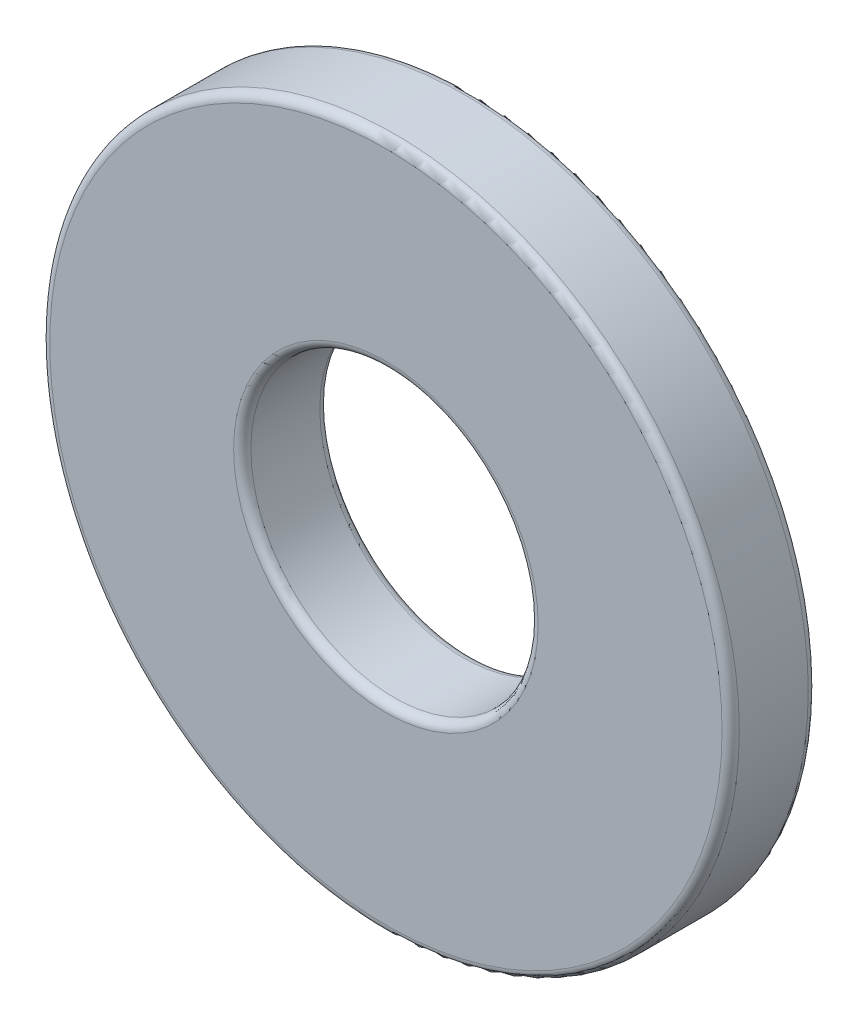
ISO-10303-21;
HEADER;
FILE_DESCRIPTION(('STEP AP214'),'2;1');
FILE_NAME('part.step','',(''),(''),'','','');
FILE_SCHEMA(('AUTOMOTIVE_DESIGN { 1 0 10303 214 1 1 1 1 }'));
ENDSEC;
DATA;
#1=APPLICATION_CONTEXT('core data for automotive mechanical design processes');
#2=APPLICATION_PROTOCOL_DEFINITION('international standard','automotive_design',2000,#1);
#3=PRODUCT_CONTEXT('',#1,'mechanical');
#4=PRODUCT('Part','Part','',(#3));
#5=PRODUCT_RELATED_PRODUCT_CATEGORY('part','',(#4));
#6=PRODUCT_DEFINITION_FORMATION('','',#4);
#7=PRODUCT_DEFINITION_CONTEXT('part definition',#1,'design');
#8=PRODUCT_DEFINITION('design','',#6,#7);
#9=PRODUCT_DEFINITION_SHAPE('','',#8);
#10=(LENGTH_UNIT() NAMED_UNIT(*) SI_UNIT(.MILLI.,.METRE.));
#11=(NAMED_UNIT(*) PLANE_ANGLE_UNIT() SI_UNIT($,.RADIAN.));
#12=(NAMED_UNIT(*) SI_UNIT($,.STERADIAN.) SOLID_ANGLE_UNIT());
#13=UNCERTAINTY_MEASURE_WITH_UNIT(LENGTH_MEASURE(1.E-05),#10,'distance_accuracy_value','');
#14=(GEOMETRIC_REPRESENTATION_CONTEXT(3) GLOBAL_UNCERTAINTY_ASSIGNED_CONTEXT((#13)) GLOBAL_UNIT_ASSIGNED_CONTEXT((#10,
#11,#12)) REPRESENTATION_CONTEXT('',''));
#15=CARTESIAN_POINT('',(0.,0.,0.));
#16=DIRECTION('',(0.,0.,1.));
#17=DIRECTION('',(1.,0.,0.));
#18=AXIS2_PLACEMENT_3D('',#15,#16,#17);
#19=CARTESIAN_POINT('',(0.,0.,1.5));
#20=DIRECTION('',(0.,0.,1.));
#21=DIRECTION('',(1.,0.,0.));
#22=AXIS2_PLACEMENT_3D('',#19,#20,#21);
#23=PLANE('',#22);
#24=CARTESIAN_POINT('',(0.,0.,1.5));
#25=DIRECTION('',(0.,0.,1.));
#26=DIRECTION('',(1.,0.,0.));
#27=AXIS2_PLACEMENT_3D('',#24,#25,#26);
#28=CIRCLE('',#27,2.65);
#29=CARTESIAN_POINT('',(2.65,0.,1.5));
#30=VERTEX_POINT('',#29);
#31=EDGE_CURVE('E10',#30,#30,#28,.F.);
#32=ORIENTED_EDGE('',*,*,#31,.T.);
#33=EDGE_LOOP('',(#32));
#34=FACE_BOUND('',#33,.T.);
#35=CARTESIAN_POINT('',(0.,0.,1.5));
#36=DIRECTION('',(0.,0.,1.));
#37=DIRECTION('',(1.,0.,0.));
#38=AXIS2_PLACEMENT_3D('',#35,#36,#37);
#39=CIRCLE('',#38,5.85);
#40=CARTESIAN_POINT('',(5.85,0.,1.5));
#41=VERTEX_POINT('',#40);
#42=EDGE_CURVE('E42',#41,#41,#39,.T.);
#43=ORIENTED_EDGE('',*,*,#42,.T.);
#44=EDGE_LOOP('',(#43));
#45=FACE_BOUND('',#44,.T.);
#46=ADVANCED_FACE('F34',(#34,#45),#23,.T.);
#47=CARTESIAN_POINT('',(0.,0.,0.));
#48=DIRECTION('',(0.,0.,1.));
#49=DIRECTION('',(1.,0.,0.));
#50=AXIS2_PLACEMENT_3D('',#47,#48,#49);
#51=PLANE('',#50);
#52=CARTESIAN_POINT('',(0.,0.,0.));
#53=DIRECTION('',(0.,0.,1.));
#54=DIRECTION('',(1.,0.,0.));
#55=AXIS2_PLACEMENT_3D('',#52,#53,#54);
#56=CIRCLE('',#55,2.65);
#57=CARTESIAN_POINT('',(2.65,0.,0.));
#58=VERTEX_POINT('',#57);
#59=EDGE_CURVE('E67',#58,#58,#56,.T.);
#60=ORIENTED_EDGE('',*,*,#59,.T.);
#61=EDGE_LOOP('',(#60));
#62=FACE_BOUND('',#61,.T.);
#63=CARTESIAN_POINT('',(0.,0.,0.));
#64=DIRECTION('',(0.,0.,1.));
#65=DIRECTION('',(1.,0.,0.));
#66=AXIS2_PLACEMENT_3D('',#63,#64,#65);
#67=CIRCLE('',#66,5.85);
#68=CARTESIAN_POINT('',(5.85,0.,0.));
#69=VERTEX_POINT('',#68);
#70=EDGE_CURVE('E71',#69,#69,#67,.F.);
#71=ORIENTED_EDGE('',*,*,#70,.T.);
#72=EDGE_LOOP('',(#71));
#73=FACE_BOUND('',#72,.T.);
#74=ADVANCED_FACE('F75',(#62,#73),#51,.F.);
#75=CARTESIAN_POINT('',(0.,0.,1.5));
#76=DIRECTION('',(0.,0.,-1.));
#77=DIRECTION('',(-1.,0.,0.));
#78=AXIS2_PLACEMENT_3D('',#75,#76,#77);
#79=CYLINDRICAL_SURFACE('',#78,6.);
#80=CARTESIAN_POINT('',(0.,0.,0.15));
#81=DIRECTION('',(0.,0.,1.));
#82=DIRECTION('',(1.,0.,0.));
#83=AXIS2_PLACEMENT_3D('',#80,#81,#82);
#84=CIRCLE('',#83,6.);
#85=CARTESIAN_POINT('',(6.,0.,0.15));
#86=VERTEX_POINT('',#85);
#87=EDGE_CURVE('E48',#86,#86,#84,.T.);
#88=ORIENTED_EDGE('',*,*,#87,.T.);
#89=EDGE_LOOP('',(#88));
#90=FACE_BOUND('',#89,.T.);
#91=CARTESIAN_POINT('',(0.,0.,1.35));
#92=DIRECTION('',(0.,0.,1.));
#93=DIRECTION('',(1.,0.,0.));
#94=AXIS2_PLACEMENT_3D('',#91,#92,#93);
#95=CIRCLE('',#94,6.);
#96=CARTESIAN_POINT('',(6.,0.,1.35));
#97=VERTEX_POINT('',#96);
#98=EDGE_CURVE('E55',#97,#97,#95,.F.);
#99=ORIENTED_EDGE('',*,*,#98,.T.);
#100=EDGE_LOOP('',(#99));
#101=FACE_BOUND('',#100,.T.);
#102=ADVANCED_FACE('F85',(#90,#101),#79,.T.);
#103=CARTESIAN_POINT('',(0.,0.,1.5));
#104=DIRECTION('',(0.,0.,-1.));
#105=DIRECTION('',(-1.,0.,0.));
#106=AXIS2_PLACEMENT_3D('',#103,#104,#105);
#107=CYLINDRICAL_SURFACE('',#106,2.5);
#108=CARTESIAN_POINT('',(0.,0.,0.15));
#109=DIRECTION('',(0.,0.,1.));
#110=DIRECTION('',(1.,0.,0.));
#111=AXIS2_PLACEMENT_3D('',#108,#109,#110);
#112=CIRCLE('',#111,2.5);
#113=CARTESIAN_POINT('',(2.5,0.,0.15));
#114=VERTEX_POINT('',#113);
#115=EDGE_CURVE('E60',#114,#114,#112,.F.);
#116=ORIENTED_EDGE('',*,*,#115,.T.);
#117=EDGE_LOOP('',(#116));
#118=FACE_BOUND('',#117,.T.);
#119=CARTESIAN_POINT('',(0.,0.,1.35));
#120=DIRECTION('',(0.,0.,1.));
#121=DIRECTION('',(1.,0.,0.));
#122=AXIS2_PLACEMENT_3D('',#119,#120,#121);
#123=CIRCLE('',#122,2.5);
#124=CARTESIAN_POINT('',(2.5,0.,1.35));
#125=VERTEX_POINT('',#124);
#126=EDGE_CURVE('E64',#125,#125,#123,.T.);
#127=ORIENTED_EDGE('',*,*,#126,.T.);
#128=EDGE_LOOP('',(#127));
#129=FACE_BOUND('',#128,.T.);
#130=ADVANCED_FACE('F88',(#118,#129),#107,.F.);
#131=CARTESIAN_POINT('',(0.,0.,0.15));
#132=DIRECTION('',(0.,0.,1.));
#133=DIRECTION('',(1.,0.,0.));
#134=AXIS2_PLACEMENT_3D('',#131,#132,#133);
#135=TOROIDAL_SURFACE('',#134,2.65,0.15);
#136=ORIENTED_EDGE('',*,*,#115,.F.);
#137=EDGE_LOOP('',(#136));
#138=FACE_BOUND('',#137,.T.);
#139=ORIENTED_EDGE('',*,*,#59,.F.);
#140=EDGE_LOOP('',(#139));
#141=FACE_BOUND('',#140,.T.);
#142=ADVANCED_FACE('F81',(#138,#141),#135,.T.);
#143=CARTESIAN_POINT('',(0.,0.,0.15));
#144=DIRECTION('',(0.,0.,1.));
#145=DIRECTION('',(1.,0.,0.));
#146=AXIS2_PLACEMENT_3D('',#143,#144,#145);
#147=TOROIDAL_SURFACE('',#146,5.85,0.15);
#148=ORIENTED_EDGE('',*,*,#70,.F.);
#149=EDGE_LOOP('',(#148));
#150=FACE_BOUND('',#149,.T.);
#151=ORIENTED_EDGE('',*,*,#87,.F.);
#152=EDGE_LOOP('',(#151));
#153=FACE_BOUND('',#152,.T.);
#154=ADVANCED_FACE('F77',(#150,#153),#147,.T.);
#155=CARTESIAN_POINT('',(0.,0.,1.35));
#156=DIRECTION('',(0.,0.,1.));
#157=DIRECTION('',(1.,0.,0.));
#158=AXIS2_PLACEMENT_3D('',#155,#156,#157);
#159=TOROIDAL_SURFACE('',#158,2.65,0.15);
#160=ORIENTED_EDGE('',*,*,#31,.F.);
#161=EDGE_LOOP('',(#160));
#162=FACE_BOUND('',#161,.T.);
#163=ORIENTED_EDGE('',*,*,#126,.F.);
#164=EDGE_LOOP('',(#163));
#165=FACE_BOUND('',#164,.T.);
#166=ADVANCED_FACE('F80',(#162,#165),#159,.T.);
#167=CARTESIAN_POINT('',(0.,0.,1.35));
#168=DIRECTION('',(0.,0.,1.));
#169=DIRECTION('',(1.,0.,0.));
#170=AXIS2_PLACEMENT_3D('',#167,#168,#169);
#171=TOROIDAL_SURFACE('',#170,5.85,0.15);
#172=ORIENTED_EDGE('',*,*,#98,.F.);
#173=EDGE_LOOP('',(#172));
#174=FACE_BOUND('',#173,.T.);
#175=ORIENTED_EDGE('',*,*,#42,.F.);
#176=EDGE_LOOP('',(#175));
#177=FACE_BOUND('',#176,.T.);
#178=ADVANCED_FACE('F36',(#174,#177),#171,.T.);
#179=CLOSED_SHELL('',(#46,#74,#102,#130,#142,#154,#166,#178));
#180=MANIFOLD_SOLID_BREP('B2',#179);
#181=ADVANCED_BREP_SHAPE_REPRESENTATION('',(#18,#180),#14);
#182=SHAPE_DEFINITION_REPRESENTATION(#9,#181);
ENDSEC;
END-ISO-10303-21;
